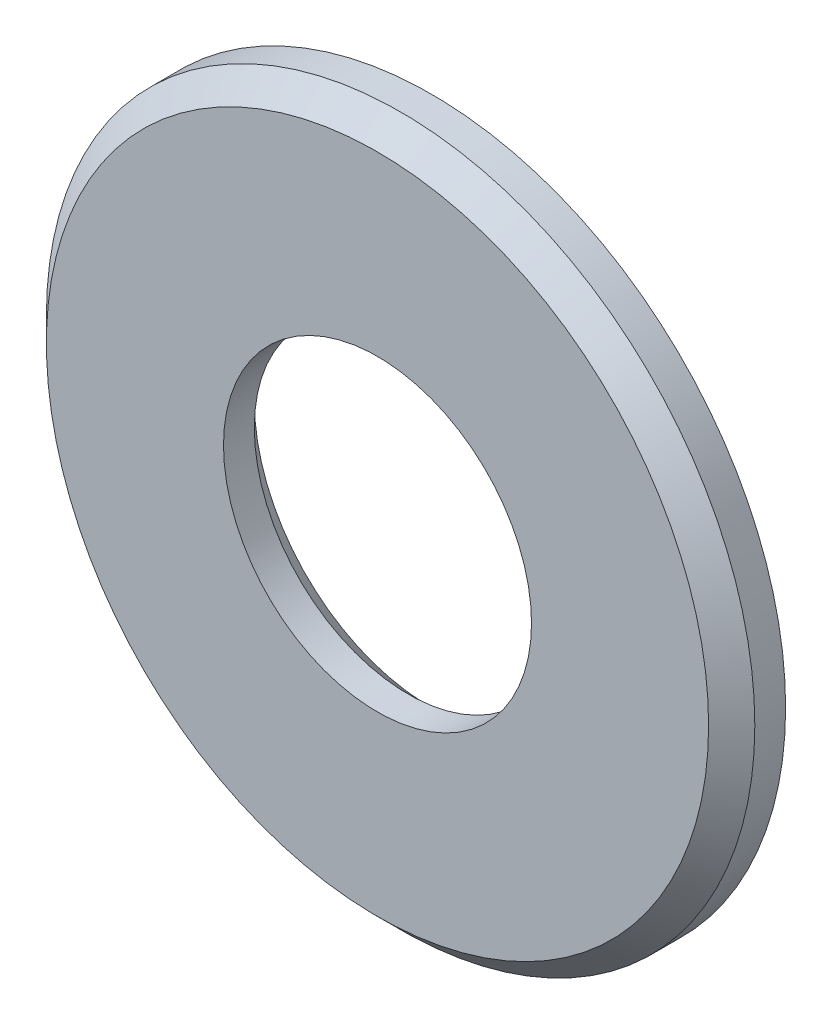
ISO-10303-21;
HEADER;
FILE_DESCRIPTION(('STEP AP214'),'2;1');
FILE_NAME('part.step','',(''),(''),'','','');
FILE_SCHEMA(('AUTOMOTIVE_DESIGN { 1 0 10303 214 1 1 1 1 }'));
ENDSEC;
DATA;
#1=APPLICATION_CONTEXT('core data for automotive mechanical design processes');
#2=APPLICATION_PROTOCOL_DEFINITION('international standard','automotive_design',2000,#1);
#3=PRODUCT_CONTEXT('',#1,'mechanical');
#4=PRODUCT('Part','Part','',(#3));
#5=PRODUCT_RELATED_PRODUCT_CATEGORY('part','',(#4));
#6=PRODUCT_DEFINITION_FORMATION('','',#4);
#7=PRODUCT_DEFINITION_CONTEXT('part definition',#1,'design');
#8=PRODUCT_DEFINITION('design','',#6,#7);
#9=PRODUCT_DEFINITION_SHAPE('','',#8);
#10=(LENGTH_UNIT() NAMED_UNIT(*) SI_UNIT(.MILLI.,.METRE.));
#11=(NAMED_UNIT(*) PLANE_ANGLE_UNIT() SI_UNIT($,.RADIAN.));
#12=(NAMED_UNIT(*) SI_UNIT($,.STERADIAN.) SOLID_ANGLE_UNIT());
#13=UNCERTAINTY_MEASURE_WITH_UNIT(LENGTH_MEASURE(1.E-05),#10,'distance_accuracy_value','');
#14=(GEOMETRIC_REPRESENTATION_CONTEXT(3) GLOBAL_UNCERTAINTY_ASSIGNED_CONTEXT((#13)) GLOBAL_UNIT_ASSIGNED_CONTEXT((#10,
#11,#12)) REPRESENTATION_CONTEXT('',''));
#15=CARTESIAN_POINT('',(0.,0.,0.));
#16=DIRECTION('',(0.,0.,1.));
#17=DIRECTION('',(1.,0.,0.));
#18=AXIS2_PLACEMENT_3D('',#15,#16,#17);
#19=CARTESIAN_POINT('',(0.,0.,3.5));
#20=DIRECTION('',(0.,0.,1.));
#21=DIRECTION('',(1.,0.,0.));
#22=AXIS2_PLACEMENT_3D('',#19,#20,#21);
#23=PLANE('',#22);
#24=CARTESIAN_POINT('',(0.,0.,3.5));
#25=DIRECTION('',(0.,0.,1.));
#26=DIRECTION('',(1.,0.,0.));
#27=AXIS2_PLACEMENT_3D('',#24,#25,#26);
#28=CIRCLE('',#27,21.5);
#29=CARTESIAN_POINT('',(21.5,0.,3.5));
#30=VERTEX_POINT('',#29);
#31=EDGE_CURVE('E37',#30,#30,#28,.T.);
#32=ORIENTED_EDGE('',*,*,#31,.T.);
#33=EDGE_LOOP('',(#32));
#34=FACE_BOUND('',#33,.T.);
#35=CARTESIAN_POINT('',(0.,0.,3.5));
#36=DIRECTION('',(0.,0.,1.));
#37=DIRECTION('',(1.,0.,0.));
#38=AXIS2_PLACEMENT_3D('',#35,#36,#37);
#39=CIRCLE('',#38,10.);
#40=CARTESIAN_POINT('',(10.,0.,3.5));
#41=VERTEX_POINT('',#40);
#42=EDGE_CURVE('E53',#41,#41,#39,.T.);
#43=ORIENTED_EDGE('',*,*,#42,.F.);
#44=EDGE_LOOP('',(#43));
#45=FACE_BOUND('',#44,.T.);
#46=ADVANCED_FACE('F30',(#34,#45),#23,.T.);
#47=CARTESIAN_POINT('',(0.,0.,0.));
#48=DIRECTION('',(0.,0.,1.));
#49=DIRECTION('',(1.,0.,0.));
#50=AXIS2_PLACEMENT_3D('',#47,#48,#49);
#51=PLANE('',#50);
#52=CARTESIAN_POINT('',(0.,0.,0.));
#53=DIRECTION('',(0.,0.,1.));
#54=DIRECTION('',(1.,0.,0.));
#55=AXIS2_PLACEMENT_3D('',#52,#53,#54);
#56=CIRCLE('',#55,11.5);
#57=CARTESIAN_POINT('',(11.5,0.,0.));
#58=VERTEX_POINT('',#57);
#59=EDGE_CURVE('E45',#58,#58,#56,.T.);
#60=ORIENTED_EDGE('',*,*,#59,.T.);
#61=EDGE_LOOP('',(#60));
#62=FACE_BOUND('',#61,.T.);
#63=CARTESIAN_POINT('',(0.,0.,0.));
#64=DIRECTION('',(0.,0.,1.));
#65=DIRECTION('',(1.,0.,0.));
#66=AXIS2_PLACEMENT_3D('',#63,#64,#65);
#67=CIRCLE('',#66,23.);
#68=CARTESIAN_POINT('',(23.,0.,0.));
#69=VERTEX_POINT('',#68);
#70=EDGE_CURVE('E50',#69,#69,#67,.T.);
#71=ORIENTED_EDGE('',*,*,#70,.F.);
#72=EDGE_LOOP('',(#71));
#73=FACE_BOUND('',#72,.T.);
#74=ADVANCED_FACE('F60',(#62,#73),#51,.F.);
#75=CARTESIAN_POINT('',(0.,0.,3.5));
#76=DIRECTION('',(0.,0.,-1.));
#77=DIRECTION('',(-1.,0.,0.));
#78=AXIS2_PLACEMENT_3D('',#75,#76,#77);
#79=CYLINDRICAL_SURFACE('',#78,23.);
#80=CARTESIAN_POINT('',(0.,0.,2.00000000000001));
#81=DIRECTION('',(0.,0.,1.));
#82=DIRECTION('',(1.,0.,0.));
#83=AXIS2_PLACEMENT_3D('',#80,#81,#82);
#84=CIRCLE('',#83,23.);
#85=CARTESIAN_POINT('',(23.,0.,2.00000000000001));
#86=VERTEX_POINT('',#85);
#87=EDGE_CURVE('E10',#86,#86,#84,.F.);
#88=ORIENTED_EDGE('',*,*,#87,.T.);
#89=EDGE_LOOP('',(#88));
#90=FACE_BOUND('',#89,.T.);
#91=ORIENTED_EDGE('',*,*,#70,.T.);
#92=EDGE_LOOP('',(#91));
#93=FACE_BOUND('',#92,.T.);
#94=ADVANCED_FACE('F65',(#90,#93),#79,.T.);
#95=CARTESIAN_POINT('',(0.,0.,3.5));
#96=DIRECTION('',(0.,0.,-1.));
#97=DIRECTION('',(-1.,0.,0.));
#98=AXIS2_PLACEMENT_3D('',#95,#96,#97);
#99=CYLINDRICAL_SURFACE('',#98,10.);
#100=CARTESIAN_POINT('',(0.,0.,1.50000000000002));
#101=DIRECTION('',(0.,0.,1.));
#102=DIRECTION('',(1.,0.,0.));
#103=AXIS2_PLACEMENT_3D('',#100,#101,#102);
#104=CIRCLE('',#103,10.);
#105=CARTESIAN_POINT('',(10.,0.,1.50000000000002));
#106=VERTEX_POINT('',#105);
#107=EDGE_CURVE('E41',#106,#106,#104,.F.);
#108=ORIENTED_EDGE('',*,*,#107,.T.);
#109=EDGE_LOOP('',(#108));
#110=FACE_BOUND('',#109,.T.);
#111=ORIENTED_EDGE('',*,*,#42,.T.);
#112=EDGE_LOOP('',(#111));
#113=FACE_BOUND('',#112,.T.);
#114=ADVANCED_FACE('F57',(#110,#113),#99,.F.);
#115=CARTESIAN_POINT('',(0.,0.,0.));
#116=DIRECTION('',(0.,0.,-1.));
#117=DIRECTION('',(-1.,0.,0.));
#118=AXIS2_PLACEMENT_3D('',#115,#116,#117);
#119=CONICAL_SURFACE('',#118,11.5,0.785398163397446);
#120=ORIENTED_EDGE('',*,*,#107,.F.);
#121=EDGE_LOOP('',(#120));
#122=FACE_BOUND('',#121,.T.);
#123=ORIENTED_EDGE('',*,*,#59,.F.);
#124=EDGE_LOOP('',(#123));
#125=FACE_BOUND('',#124,.T.);
#126=ADVANCED_FACE('F71',(#122,#125),#119,.F.);
#127=CARTESIAN_POINT('',(0.,0.,3.5));
#128=DIRECTION('',(0.,0.,-1.));
#129=DIRECTION('',(-1.,0.,0.));
#130=AXIS2_PLACEMENT_3D('',#127,#128,#129);
#131=CONICAL_SURFACE('',#130,21.5,0.785398163397445);
#132=ORIENTED_EDGE('',*,*,#87,.F.);
#133=EDGE_LOOP('',(#132));
#134=FACE_BOUND('',#133,.T.);
#135=ORIENTED_EDGE('',*,*,#31,.F.);
#136=EDGE_LOOP('',(#135));
#137=FACE_BOUND('',#136,.T.);
#138=ADVANCED_FACE('F32',(#134,#137),#131,.T.);
#139=CLOSED_SHELL('',(#46,#74,#94,#114,#126,#138));
#140=MANIFOLD_SOLID_BREP('B2',#139);
#141=ADVANCED_BREP_SHAPE_REPRESENTATION('',(#18,#140),#14);
#142=SHAPE_DEFINITION_REPRESENTATION(#9,#141);
ENDSEC;
END-ISO-10303-21;
